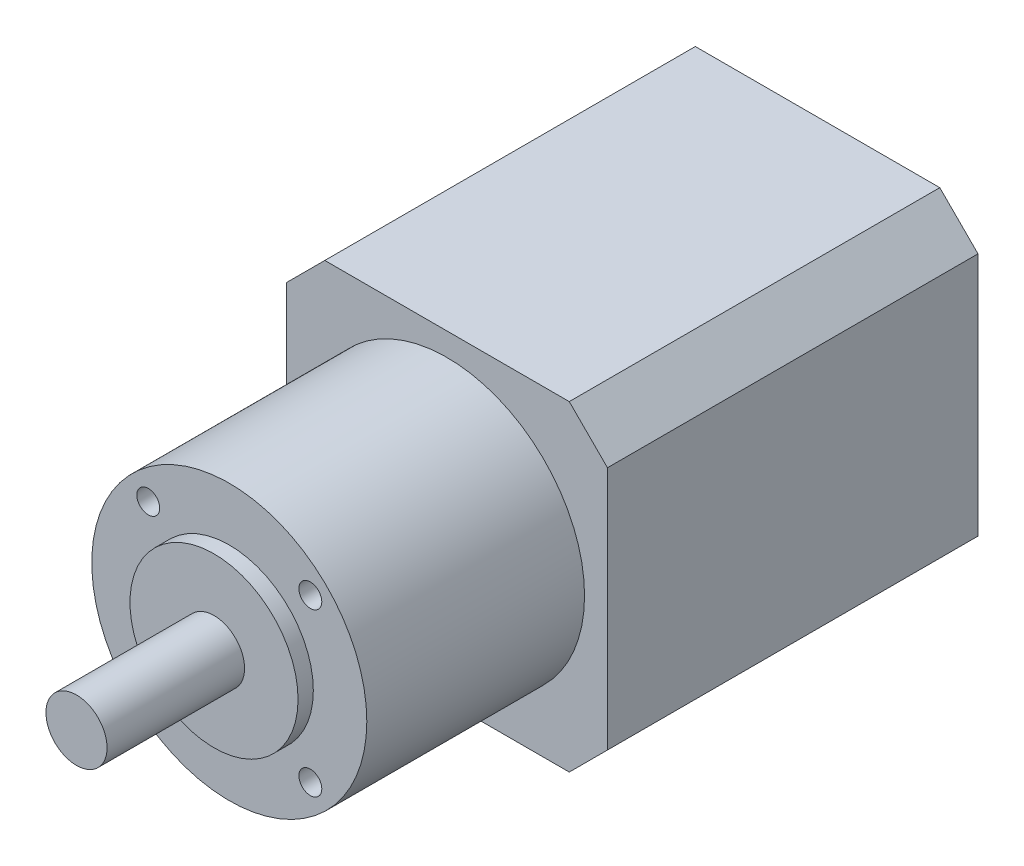
ISO-10303-21;
HEADER;
FILE_DESCRIPTION(('STEP AP214'),'2;1');
FILE_NAME('part.step','',(''),(''),'','','');
FILE_SCHEMA(('AUTOMOTIVE_DESIGN { 1 0 10303 214 1 1 1 1 }'));
ENDSEC;
DATA;
#1=APPLICATION_CONTEXT('core data for automotive mechanical design processes');
#2=APPLICATION_PROTOCOL_DEFINITION('international standard','automotive_design',2000,#1);
#3=PRODUCT_CONTEXT('',#1,'mechanical');
#4=PRODUCT('Part','Part','',(#3));
#5=PRODUCT_RELATED_PRODUCT_CATEGORY('part','',(#4));
#6=PRODUCT_DEFINITION_FORMATION('','',#4);
#7=PRODUCT_DEFINITION_CONTEXT('part definition',#1,'design');
#8=PRODUCT_DEFINITION('design','',#6,#7);
#9=PRODUCT_DEFINITION_SHAPE('','',#8);
#10=(LENGTH_UNIT() NAMED_UNIT(*) SI_UNIT(.MILLI.,.METRE.));
#11=(NAMED_UNIT(*) PLANE_ANGLE_UNIT() SI_UNIT($,.RADIAN.));
#12=(NAMED_UNIT(*) SI_UNIT($,.STERADIAN.) SOLID_ANGLE_UNIT());
#13=UNCERTAINTY_MEASURE_WITH_UNIT(LENGTH_MEASURE(1.E-05),#10,'distance_accuracy_value','');
#14=(GEOMETRIC_REPRESENTATION_CONTEXT(3) GLOBAL_UNCERTAINTY_ASSIGNED_CONTEXT((#13)) GLOBAL_UNIT_ASSIGNED_CONTEXT((#10,
#11,#12)) REPRESENTATION_CONTEXT('',''));
#15=CARTESIAN_POINT('',(0.,0.,0.));
#16=DIRECTION('',(0.,0.,1.));
#17=DIRECTION('',(1.,0.,0.));
#18=AXIS2_PLACEMENT_3D('',#15,#16,#17);
#19=CARTESIAN_POINT('',(21.,21.,48.5));
#20=DIRECTION('',(-1.,0.,0.));
#21=DIRECTION('',(0.,-1.,0.));
#22=AXIS2_PLACEMENT_3D('',#19,#20,#21);
#23=PLANE('',#22);
#24=DIRECTION('',(0.,1.,0.));
#25=VECTOR('',#24,1.);
#26=CARTESIAN_POINT('',(21.,21.,48.5));
#27=LINE('',#26,#25);
#28=CARTESIAN_POINT('',(21.,-16.,48.5));
#29=VERTEX_POINT('',#28);
#30=CARTESIAN_POINT('',(21.,16.,48.5));
#31=VERTEX_POINT('',#30);
#32=EDGE_CURVE('E122',#29,#31,#27,.T.);
#33=ORIENTED_EDGE('',*,*,#32,.F.);
#34=DIRECTION('',(0.,0.,-1.));
#35=VECTOR('',#34,1.);
#36=CARTESIAN_POINT('',(21.,-16.,48.5));
#37=LINE('',#36,#35);
#38=CARTESIAN_POINT('',(21.,-16.,0.));
#39=VERTEX_POINT('',#38);
#40=EDGE_CURVE('E107',#29,#39,#37,.T.);
#41=ORIENTED_EDGE('',*,*,#40,.T.);
#42=DIRECTION('',(0.,1.,0.));
#43=VECTOR('',#42,1.);
#44=CARTESIAN_POINT('',(21.,21.,0.));
#45=LINE('',#44,#43);
#46=CARTESIAN_POINT('',(21.,16.,0.));
#47=VERTEX_POINT('',#46);
#48=EDGE_CURVE('E119',#39,#47,#45,.T.);
#49=ORIENTED_EDGE('',*,*,#48,.T.);
#50=DIRECTION('',(0.,0.,1.));
#51=VECTOR('',#50,1.);
#52=CARTESIAN_POINT('',(21.,16.,48.5));
#53=LINE('',#52,#51);
#54=EDGE_CURVE('E124',#47,#31,#53,.T.);
#55=ORIENTED_EDGE('',*,*,#54,.T.);
#56=EDGE_LOOP('',(#33,#41,#49,#55));
#57=FACE_BOUND('',#56,.T.);
#58=ADVANCED_FACE('F37',(#57),#23,.F.);
#59=CARTESIAN_POINT('',(-21.,21.,48.5));
#60=DIRECTION('',(0.,-1.,0.));
#61=DIRECTION('',(0.,0.,-1.));
#62=AXIS2_PLACEMENT_3D('',#59,#60,#61);
#63=PLANE('',#62);
#64=DIRECTION('',(-1.,0.,0.));
#65=VECTOR('',#64,1.);
#66=CARTESIAN_POINT('',(-21.,21.,48.5));
#67=LINE('',#66,#65);
#68=CARTESIAN_POINT('',(16.,21.,48.5));
#69=VERTEX_POINT('',#68);
#70=CARTESIAN_POINT('',(-16.,21.,48.5));
#71=VERTEX_POINT('',#70);
#72=EDGE_CURVE('E169',#69,#71,#67,.T.);
#73=ORIENTED_EDGE('',*,*,#72,.F.);
#74=DIRECTION('',(0.,0.,-1.));
#75=VECTOR('',#74,1.);
#76=CARTESIAN_POINT('',(16.,21.,48.5));
#77=LINE('',#76,#75);
#78=CARTESIAN_POINT('',(16.,21.,0.));
#79=VERTEX_POINT('',#78);
#80=EDGE_CURVE('E162',#69,#79,#77,.T.);
#81=ORIENTED_EDGE('',*,*,#80,.T.);
#82=DIRECTION('',(-1.,0.,0.));
#83=VECTOR('',#82,1.);
#84=CARTESIAN_POINT('',(-21.,21.,0.));
#85=LINE('',#84,#83);
#86=CARTESIAN_POINT('',(-16.,21.,0.));
#87=VERTEX_POINT('',#86);
#88=EDGE_CURVE('E128',#79,#87,#85,.T.);
#89=ORIENTED_EDGE('',*,*,#88,.T.);
#90=DIRECTION('',(0.,0.,1.));
#91=VECTOR('',#90,1.);
#92=CARTESIAN_POINT('',(-16.,21.,48.5));
#93=LINE('',#92,#91);
#94=EDGE_CURVE('E160',#87,#71,#93,.T.);
#95=ORIENTED_EDGE('',*,*,#94,.T.);
#96=EDGE_LOOP('',(#73,#81,#89,#95));
#97=FACE_BOUND('',#96,.T.);
#98=ADVANCED_FACE('F167',(#97),#63,.F.);
#99=CARTESIAN_POINT('',(-21.,21.,48.5));
#100=DIRECTION('',(1.,0.,0.));
#101=DIRECTION('',(0.,1.,0.));
#102=AXIS2_PLACEMENT_3D('',#99,#100,#101);
#103=PLANE('',#102);
#104=DIRECTION('',(0.,-1.,0.));
#105=VECTOR('',#104,1.);
#106=CARTESIAN_POINT('',(-21.,21.,48.5));
#107=LINE('',#106,#105);
#108=CARTESIAN_POINT('',(-21.,16.,48.5));
#109=VERTEX_POINT('',#108);
#110=CARTESIAN_POINT('',(-21.,-16.,48.5));
#111=VERTEX_POINT('',#110);
#112=EDGE_CURVE('E177',#109,#111,#107,.T.);
#113=ORIENTED_EDGE('',*,*,#112,.F.);
#114=DIRECTION('',(0.,0.,-1.));
#115=VECTOR('',#114,1.);
#116=CARTESIAN_POINT('',(-21.,16.,48.5));
#117=LINE('',#116,#115);
#118=CARTESIAN_POINT('',(-21.,16.,0.));
#119=VERTEX_POINT('',#118);
#120=EDGE_CURVE('E11',#109,#119,#117,.T.);
#121=ORIENTED_EDGE('',*,*,#120,.T.);
#122=DIRECTION('',(0.,-1.,0.));
#123=VECTOR('',#122,1.);
#124=CARTESIAN_POINT('',(-21.,21.,0.));
#125=LINE('',#124,#123);
#126=CARTESIAN_POINT('',(-21.,-16.,0.));
#127=VERTEX_POINT('',#126);
#128=EDGE_CURVE('E132',#119,#127,#125,.T.);
#129=ORIENTED_EDGE('',*,*,#128,.T.);
#130=DIRECTION('',(0.,0.,1.));
#131=VECTOR('',#130,1.);
#132=CARTESIAN_POINT('',(-21.,-16.,48.5));
#133=LINE('',#132,#131);
#134=EDGE_CURVE('E45',#127,#111,#133,.T.);
#135=ORIENTED_EDGE('',*,*,#134,.T.);
#136=EDGE_LOOP('',(#113,#121,#129,#135));
#137=FACE_BOUND('',#136,.T.);
#138=ADVANCED_FACE('F176',(#137),#103,.F.);
#139=CARTESIAN_POINT('',(-21.,-21.,48.5));
#140=DIRECTION('',(0.,1.,0.));
#141=DIRECTION('',(0.,0.,1.));
#142=AXIS2_PLACEMENT_3D('',#139,#140,#141);
#143=PLANE('',#142);
#144=DIRECTION('',(1.,0.,0.));
#145=VECTOR('',#144,1.);
#146=CARTESIAN_POINT('',(-21.,-21.,0.));
#147=LINE('',#146,#145);
#148=CARTESIAN_POINT('',(-16.,-21.,0.));
#149=VERTEX_POINT('',#148);
#150=CARTESIAN_POINT('',(16.,-21.,0.));
#151=VERTEX_POINT('',#150);
#152=EDGE_CURVE('E142',#149,#151,#147,.T.);
#153=ORIENTED_EDGE('',*,*,#152,.T.);
#154=DIRECTION('',(0.,0.,1.));
#155=VECTOR('',#154,1.);
#156=CARTESIAN_POINT('',(16.,-21.,48.5));
#157=LINE('',#156,#155);
#158=CARTESIAN_POINT('',(16.,-21.,48.5));
#159=VERTEX_POINT('',#158);
#160=EDGE_CURVE('E108',#151,#159,#157,.T.);
#161=ORIENTED_EDGE('',*,*,#160,.T.);
#162=DIRECTION('',(1.,0.,0.));
#163=VECTOR('',#162,1.);
#164=CARTESIAN_POINT('',(-21.,-21.,48.5));
#165=LINE('',#164,#163);
#166=CARTESIAN_POINT('',(-16.,-21.,48.5));
#167=VERTEX_POINT('',#166);
#168=EDGE_CURVE('E138',#167,#159,#165,.T.);
#169=ORIENTED_EDGE('',*,*,#168,.F.);
#170=DIRECTION('',(0.,0.,-1.));
#171=VECTOR('',#170,1.);
#172=CARTESIAN_POINT('',(-16.,-21.,48.5));
#173=LINE('',#172,#171);
#174=EDGE_CURVE('E113',#167,#149,#173,.T.);
#175=ORIENTED_EDGE('',*,*,#174,.T.);
#176=EDGE_LOOP('',(#153,#161,#169,#175));
#177=FACE_BOUND('',#176,.T.);
#178=ADVANCED_FACE('F243',(#177),#143,.F.);
#179=CARTESIAN_POINT('',(0.,0.,48.5));
#180=DIRECTION('',(0.,0.,1.));
#181=DIRECTION('',(1.,0.,0.));
#182=AXIS2_PLACEMENT_3D('',#179,#180,#181);
#183=PLANE('',#182);
#184=CARTESIAN_POINT('',(0.,0.,48.5));
#185=DIRECTION('',(0.,0.,1.));
#186=DIRECTION('',(1.,0.,0.));
#187=AXIS2_PLACEMENT_3D('',#184,#185,#186);
#188=CIRCLE('',#187,18.);
#189=CARTESIAN_POINT('',(18.,0.,48.5));
#190=VERTEX_POINT('',#189);
#191=EDGE_CURVE('E144',#190,#190,#188,.T.);
#192=ORIENTED_EDGE('',*,*,#191,.F.);
#193=EDGE_LOOP('',(#192));
#194=FACE_BOUND('',#193,.T.);
#195=ORIENTED_EDGE('',*,*,#168,.T.);
#196=DIRECTION('',(-0.70710678118655,-0.707106781186546,0.));
#197=VECTOR('',#196,1.);
#198=CARTESIAN_POINT('',(18.4999999999999,-18.5,48.5));
#199=LINE('',#198,#197);
#200=EDGE_CURVE('E158',#159,#29,#199,.F.);
#201=ORIENTED_EDGE('',*,*,#200,.T.);
#202=ORIENTED_EDGE('',*,*,#32,.T.);
#203=DIRECTION('',(0.707106781186546,-0.707106781186549,0.));
#204=VECTOR('',#203,1.);
#205=CARTESIAN_POINT('',(18.5,18.5,48.5));
#206=LINE('',#205,#204);
#207=EDGE_CURVE('E156',#31,#69,#206,.F.);
#208=ORIENTED_EDGE('',*,*,#207,.T.);
#209=ORIENTED_EDGE('',*,*,#72,.T.);
#210=DIRECTION('',(0.707106781186548,0.707106781186547,0.));
#211=VECTOR('',#210,1.);
#212=CARTESIAN_POINT('',(-18.5,18.5,48.5));
#213=LINE('',#212,#211);
#214=EDGE_CURVE('E58',#71,#109,#213,.F.);
#215=ORIENTED_EDGE('',*,*,#214,.T.);
#216=ORIENTED_EDGE('',*,*,#112,.T.);
#217=DIRECTION('',(-0.707106781186546,0.707106781186549,0.));
#218=VECTOR('',#217,1.);
#219=CARTESIAN_POINT('',(-18.5,-18.5,48.5));
#220=LINE('',#219,#218);
#221=EDGE_CURVE('E153',#111,#167,#220,.F.);
#222=ORIENTED_EDGE('',*,*,#221,.T.);
#223=EDGE_LOOP('',(#195,#201,#202,#208,#209,#215,#216,#222));
#224=FACE_BOUND('',#223,.T.);
#225=ADVANCED_FACE('F241',(#194,#224),#183,.T.);
#226=CARTESIAN_POINT('',(0.,0.,0.));
#227=DIRECTION('',(0.,0.,1.));
#228=DIRECTION('',(1.,0.,0.));
#229=AXIS2_PLACEMENT_3D('',#226,#227,#228);
#230=PLANE('',#229);
#231=ORIENTED_EDGE('',*,*,#48,.F.);
#232=DIRECTION('',(0.70710678118655,0.707106781186546,0.));
#233=VECTOR('',#232,1.);
#234=CARTESIAN_POINT('',(21.,-16.,0.));
#235=LINE('',#234,#233);
#236=EDGE_CURVE('E103',#39,#151,#235,.F.);
#237=ORIENTED_EDGE('',*,*,#236,.T.);
#238=ORIENTED_EDGE('',*,*,#152,.F.);
#239=DIRECTION('',(0.707106781186546,-0.707106781186549,0.));
#240=VECTOR('',#239,1.);
#241=CARTESIAN_POINT('',(-16.,-21.,0.));
#242=LINE('',#241,#240);
#243=EDGE_CURVE('E123',#149,#127,#242,.F.);
#244=ORIENTED_EDGE('',*,*,#243,.T.);
#245=ORIENTED_EDGE('',*,*,#128,.F.);
#246=DIRECTION('',(-0.707106781186548,-0.707106781186547,0.));
#247=VECTOR('',#246,1.);
#248=CARTESIAN_POINT('',(-21.,16.,0.));
#249=LINE('',#248,#247);
#250=EDGE_CURVE('E147',#119,#87,#249,.F.);
#251=ORIENTED_EDGE('',*,*,#250,.T.);
#252=ORIENTED_EDGE('',*,*,#88,.F.);
#253=DIRECTION('',(-0.707106781186546,0.707106781186549,0.));
#254=VECTOR('',#253,1.);
#255=CARTESIAN_POINT('',(16.,21.,0.));
#256=LINE('',#255,#254);
#257=EDGE_CURVE('E114',#79,#47,#256,.F.);
#258=ORIENTED_EDGE('',*,*,#257,.T.);
#259=EDGE_LOOP('',(#231,#237,#238,#244,#245,#251,#252,#258));
#260=FACE_BOUND('',#259,.T.);
#261=ADVANCED_FACE('F126',(#260),#230,.F.);
#262=CARTESIAN_POINT('',(0.,0.,77.));
#263=DIRECTION('',(0.,0.,-1.));
#264=DIRECTION('',(-1.,0.,0.));
#265=AXIS2_PLACEMENT_3D('',#262,#263,#264);
#266=CYLINDRICAL_SURFACE('',#265,18.);
#267=CARTESIAN_POINT('',(0.,0.,77.));
#268=DIRECTION('',(0.,0.,1.));
#269=DIRECTION('',(1.,0.,0.));
#270=AXIS2_PLACEMENT_3D('',#267,#268,#269);
#271=CIRCLE('',#270,18.);
#272=CARTESIAN_POINT('',(18.,0.,77.));
#273=VERTEX_POINT('',#272);
#274=EDGE_CURVE('E129',#273,#273,#271,.T.);
#275=ORIENTED_EDGE('',*,*,#274,.F.);
#276=EDGE_LOOP('',(#275));
#277=FACE_BOUND('',#276,.T.);
#278=ORIENTED_EDGE('',*,*,#191,.T.);
#279=EDGE_LOOP('',(#278));
#280=FACE_BOUND('',#279,.T.);
#281=ADVANCED_FACE('F227',(#277,#280),#266,.T.);
#282=CARTESIAN_POINT('',(0.,0.,77.));
#283=DIRECTION('',(0.,0.,1.));
#284=DIRECTION('',(1.,0.,0.));
#285=AXIS2_PLACEMENT_3D('',#282,#283,#284);
#286=PLANE('',#285);
#287=CARTESIAN_POINT('',(10.6066017177982,-10.6066017177982,77.));
#288=DIRECTION('',(0.,0.,1.));
#289=DIRECTION('',(1.,0.,0.));
#290=AXIS2_PLACEMENT_3D('',#287,#288,#289);
#291=CIRCLE('',#290,1.5);
#292=CARTESIAN_POINT('',(12.1066017177982,-10.6066017177982,77.));
#293=VERTEX_POINT('',#292);
#294=EDGE_CURVE('E206',#293,#293,#291,.T.);
#295=ORIENTED_EDGE('',*,*,#294,.F.);
#296=EDGE_LOOP('',(#295));
#297=FACE_BOUND('',#296,.T.);
#298=CARTESIAN_POINT('',(10.6066017177983,10.6066017177981,77.));
#299=DIRECTION('',(0.,0.,1.));
#300=DIRECTION('',(1.,0.,0.));
#301=AXIS2_PLACEMENT_3D('',#298,#299,#300);
#302=CIRCLE('',#301,1.5);
#303=CARTESIAN_POINT('',(12.1066017177983,10.6066017177981,77.));
#304=VERTEX_POINT('',#303);
#305=EDGE_CURVE('E212',#304,#304,#302,.T.);
#306=ORIENTED_EDGE('',*,*,#305,.F.);
#307=EDGE_LOOP('',(#306));
#308=FACE_BOUND('',#307,.T.);
#309=CARTESIAN_POINT('',(-10.6066017177981,10.6066017177983,77.));
#310=DIRECTION('',(0.,0.,1.));
#311=DIRECTION('',(1.,0.,0.));
#312=AXIS2_PLACEMENT_3D('',#309,#310,#311);
#313=CIRCLE('',#312,1.5);
#314=CARTESIAN_POINT('',(-9.10660171779814,10.6066017177983,77.));
#315=VERTEX_POINT('',#314);
#316=EDGE_CURVE('E200',#315,#315,#313,.T.);
#317=ORIENTED_EDGE('',*,*,#316,.F.);
#318=EDGE_LOOP('',(#317));
#319=FACE_BOUND('',#318,.T.);
#320=CARTESIAN_POINT('',(-10.6066017177982,-10.6066017177982,77.));
#321=DIRECTION('',(0.,0.,1.));
#322=DIRECTION('',(1.,0.,0.));
#323=AXIS2_PLACEMENT_3D('',#320,#321,#322);
#324=CIRCLE('',#323,1.5);
#325=CARTESIAN_POINT('',(-9.10660171779825,-10.6066017177982,77.));
#326=VERTEX_POINT('',#325);
#327=EDGE_CURVE('E197',#326,#326,#324,.T.);
#328=ORIENTED_EDGE('',*,*,#327,.F.);
#329=EDGE_LOOP('',(#328));
#330=FACE_BOUND('',#329,.T.);
#331=CARTESIAN_POINT('',(0.,0.,77.));
#332=DIRECTION('',(0.,0.,1.));
#333=DIRECTION('',(1.,0.,0.));
#334=AXIS2_PLACEMENT_3D('',#331,#332,#333);
#335=CIRCLE('',#334,11.);
#336=CARTESIAN_POINT('',(11.,0.,77.));
#337=VERTEX_POINT('',#336);
#338=EDGE_CURVE('E185',#337,#337,#335,.T.);
#339=ORIENTED_EDGE('',*,*,#338,.F.);
#340=EDGE_LOOP('',(#339));
#341=FACE_BOUND('',#340,.T.);
#342=ORIENTED_EDGE('',*,*,#274,.T.);
#343=EDGE_LOOP('',(#342));
#344=FACE_BOUND('',#343,.T.);
#345=ADVANCED_FACE('F223',(#297,#308,#319,#330,#341,#344),#286,.T.);
#346=CARTESIAN_POINT('',(0.,0.,79.));
#347=DIRECTION('',(0.,0.,1.));
#348=DIRECTION('',(1.,0.,0.));
#349=AXIS2_PLACEMENT_3D('',#346,#347,#348);
#350=PLANE('',#349);
#351=CARTESIAN_POINT('',(0.,0.,79.));
#352=DIRECTION('',(0.,0.,1.));
#353=DIRECTION('',(1.,0.,0.));
#354=AXIS2_PLACEMENT_3D('',#351,#352,#353);
#355=CIRCLE('',#354,11.);
#356=CARTESIAN_POINT('',(11.,0.,79.));
#357=VERTEX_POINT('',#356);
#358=EDGE_CURVE('E135',#357,#357,#355,.T.);
#359=ORIENTED_EDGE('',*,*,#358,.T.);
#360=EDGE_LOOP('',(#359));
#361=FACE_BOUND('',#360,.T.);
#362=CARTESIAN_POINT('',(0.,0.,79.));
#363=DIRECTION('',(0.,0.,1.));
#364=DIRECTION('',(1.,0.,0.));
#365=AXIS2_PLACEMENT_3D('',#362,#363,#364);
#366=CIRCLE('',#365,4.);
#367=CARTESIAN_POINT('',(4.,0.,79.));
#368=VERTEX_POINT('',#367);
#369=EDGE_CURVE('E188',#368,#368,#366,.T.);
#370=ORIENTED_EDGE('',*,*,#369,.F.);
#371=EDGE_LOOP('',(#370));
#372=FACE_BOUND('',#371,.T.);
#373=ADVANCED_FACE('F226',(#361,#372),#350,.T.);
#374=CARTESIAN_POINT('',(0.,0.,79.));
#375=DIRECTION('',(0.,0.,-1.));
#376=DIRECTION('',(-1.,0.,0.));
#377=AXIS2_PLACEMENT_3D('',#374,#375,#376);
#378=CYLINDRICAL_SURFACE('',#377,11.);
#379=ORIENTED_EDGE('',*,*,#358,.F.);
#380=EDGE_LOOP('',(#379));
#381=FACE_BOUND('',#380,.T.);
#382=ORIENTED_EDGE('',*,*,#338,.T.);
#383=EDGE_LOOP('',(#382));
#384=FACE_BOUND('',#383,.T.);
#385=ADVANCED_FACE('F376',(#381,#384),#378,.T.);
#386=CARTESIAN_POINT('',(0.,0.,97.));
#387=DIRECTION('',(0.,0.,-1.));
#388=DIRECTION('',(-1.,0.,0.));
#389=AXIS2_PLACEMENT_3D('',#386,#387,#388);
#390=CYLINDRICAL_SURFACE('',#389,4.);
#391=ORIENTED_EDGE('',*,*,#369,.T.);
#392=EDGE_LOOP('',(#391));
#393=FACE_BOUND('',#392,.T.);
#394=CARTESIAN_POINT('',(0.,0.,97.));
#395=DIRECTION('',(0.,0.,1.));
#396=DIRECTION('',(1.,0.,0.));
#397=AXIS2_PLACEMENT_3D('',#394,#395,#396);
#398=CIRCLE('',#397,4.);
#399=CARTESIAN_POINT('',(4.,0.,97.));
#400=VERTEX_POINT('',#399);
#401=EDGE_CURVE('E193',#400,#400,#398,.T.);
#402=ORIENTED_EDGE('',*,*,#401,.F.);
#403=EDGE_LOOP('',(#402));
#404=FACE_BOUND('',#403,.T.);
#405=ADVANCED_FACE('F367',(#393,#404),#390,.T.);
#406=CARTESIAN_POINT('',(0.,0.,97.));
#407=DIRECTION('',(0.,0.,1.));
#408=DIRECTION('',(1.,0.,0.));
#409=AXIS2_PLACEMENT_3D('',#406,#407,#408);
#410=PLANE('',#409);
#411=ORIENTED_EDGE('',*,*,#401,.T.);
#412=EDGE_LOOP('',(#411));
#413=FACE_BOUND('',#412,.T.);
#414=ADVANCED_FACE('F357',(#413),#410,.T.);
#415=CARTESIAN_POINT('',(-10.6066017177982,-10.6066017177982,67.));
#416=DIRECTION('',(0.,0.,1.));
#417=DIRECTION('',(1.,0.,0.));
#418=AXIS2_PLACEMENT_3D('',#415,#416,#417);
#419=CYLINDRICAL_SURFACE('',#418,1.5);
#420=CARTESIAN_POINT('',(-10.6066017177982,-10.6066017177982,67.));
#421=DIRECTION('',(0.,0.,1.));
#422=DIRECTION('',(1.,0.,0.));
#423=AXIS2_PLACEMENT_3D('',#420,#421,#422);
#424=CIRCLE('',#423,1.5);
#425=CARTESIAN_POINT('',(-9.10660171779825,-10.6066017177982,67.));
#426=VERTEX_POINT('',#425);
#427=EDGE_CURVE('E196',#426,#426,#424,.T.);
#428=ORIENTED_EDGE('',*,*,#427,.F.);
#429=EDGE_LOOP('',(#428));
#430=FACE_BOUND('',#429,.T.);
#431=ORIENTED_EDGE('',*,*,#327,.T.);
#432=EDGE_LOOP('',(#431));
#433=FACE_BOUND('',#432,.T.);
#434=ADVANCED_FACE('F348',(#430,#433),#419,.F.);
#435=CARTESIAN_POINT('',(-10.6066017177982,-10.6066017177982,67.));
#436=DIRECTION('',(0.,0.,1.));
#437=DIRECTION('',(1.,0.,0.));
#438=AXIS2_PLACEMENT_3D('',#435,#436,#437);
#439=PLANE('',#438);
#440=ORIENTED_EDGE('',*,*,#427,.T.);
#441=EDGE_LOOP('',(#440));
#442=FACE_BOUND('',#441,.T.);
#443=ADVANCED_FACE('F339',(#442),#439,.T.);
#444=CARTESIAN_POINT('',(-10.6066017177981,10.6066017177983,67.));
#445=DIRECTION('',(0.,0.,1.));
#446=DIRECTION('',(1.,0.,0.));
#447=AXIS2_PLACEMENT_3D('',#444,#445,#446);
#448=CYLINDRICAL_SURFACE('',#447,1.5);
#449=CARTESIAN_POINT('',(-10.6066017177981,10.6066017177983,67.));
#450=DIRECTION('',(0.,0.,1.));
#451=DIRECTION('',(1.,0.,0.));
#452=AXIS2_PLACEMENT_3D('',#449,#450,#451);
#453=CIRCLE('',#452,1.5);
#454=CARTESIAN_POINT('',(-9.10660171779814,10.6066017177983,67.));
#455=VERTEX_POINT('',#454);
#456=EDGE_CURVE('E215',#455,#455,#453,.T.);
#457=ORIENTED_EDGE('',*,*,#456,.F.);
#458=EDGE_LOOP('',(#457));
#459=FACE_BOUND('',#458,.T.);
#460=ORIENTED_EDGE('',*,*,#316,.T.);
#461=EDGE_LOOP('',(#460));
#462=FACE_BOUND('',#461,.T.);
#463=ADVANCED_FACE('F221',(#459,#462),#448,.F.);
#464=CARTESIAN_POINT('',(-10.6066017177981,10.6066017177983,67.));
#465=DIRECTION('',(0.,0.,1.));
#466=DIRECTION('',(1.,0.,0.));
#467=AXIS2_PLACEMENT_3D('',#464,#465,#466);
#468=PLANE('',#467);
#469=ORIENTED_EDGE('',*,*,#456,.T.);
#470=EDGE_LOOP('',(#469));
#471=FACE_BOUND('',#470,.T.);
#472=ADVANCED_FACE('F322',(#471),#468,.T.);
#473=CARTESIAN_POINT('',(10.6066017177983,10.6066017177981,67.));
#474=DIRECTION('',(0.,0.,1.));
#475=DIRECTION('',(1.,0.,0.));
#476=AXIS2_PLACEMENT_3D('',#473,#474,#475);
#477=CYLINDRICAL_SURFACE('',#476,1.5);
#478=CARTESIAN_POINT('',(10.6066017177983,10.6066017177981,67.));
#479=DIRECTION('',(0.,0.,1.));
#480=DIRECTION('',(1.,0.,0.));
#481=AXIS2_PLACEMENT_3D('',#478,#479,#480);
#482=CIRCLE('',#481,1.5);
#483=CARTESIAN_POINT('',(12.1066017177983,10.6066017177981,67.));
#484=VERTEX_POINT('',#483);
#485=EDGE_CURVE('E209',#484,#484,#482,.T.);
#486=ORIENTED_EDGE('',*,*,#485,.F.);
#487=EDGE_LOOP('',(#486));
#488=FACE_BOUND('',#487,.T.);
#489=ORIENTED_EDGE('',*,*,#305,.T.);
#490=EDGE_LOOP('',(#489));
#491=FACE_BOUND('',#490,.T.);
#492=ADVANCED_FACE('F313',(#488,#491),#477,.F.);
#493=CARTESIAN_POINT('',(10.6066017177983,10.6066017177981,67.));
#494=DIRECTION('',(0.,0.,1.));
#495=DIRECTION('',(1.,0.,0.));
#496=AXIS2_PLACEMENT_3D('',#493,#494,#495);
#497=PLANE('',#496);
#498=ORIENTED_EDGE('',*,*,#485,.T.);
#499=EDGE_LOOP('',(#498));
#500=FACE_BOUND('',#499,.T.);
#501=ADVANCED_FACE('F304',(#500),#497,.T.);
#502=CARTESIAN_POINT('',(10.6066017177982,-10.6066017177982,67.));
#503=DIRECTION('',(0.,0.,1.));
#504=DIRECTION('',(1.,0.,0.));
#505=AXIS2_PLACEMENT_3D('',#502,#503,#504);
#506=CYLINDRICAL_SURFACE('',#505,1.5);
#507=CARTESIAN_POINT('',(10.6066017177982,-10.6066017177982,67.));
#508=DIRECTION('',(0.,0.,1.));
#509=DIRECTION('',(1.,0.,0.));
#510=AXIS2_PLACEMENT_3D('',#507,#508,#509);
#511=CIRCLE('',#510,1.5);
#512=CARTESIAN_POINT('',(12.1066017177982,-10.6066017177982,67.));
#513=VERTEX_POINT('',#512);
#514=EDGE_CURVE('E203',#513,#513,#511,.T.);
#515=ORIENTED_EDGE('',*,*,#514,.F.);
#516=EDGE_LOOP('',(#515));
#517=FACE_BOUND('',#516,.T.);
#518=ORIENTED_EDGE('',*,*,#294,.T.);
#519=EDGE_LOOP('',(#518));
#520=FACE_BOUND('',#519,.T.);
#521=ADVANCED_FACE('F295',(#517,#520),#506,.F.);
#522=CARTESIAN_POINT('',(10.6066017177982,-10.6066017177982,67.));
#523=DIRECTION('',(0.,0.,1.));
#524=DIRECTION('',(1.,0.,0.));
#525=AXIS2_PLACEMENT_3D('',#522,#523,#524);
#526=PLANE('',#525);
#527=ORIENTED_EDGE('',*,*,#514,.T.);
#528=EDGE_LOOP('',(#527));
#529=FACE_BOUND('',#528,.T.);
#530=ADVANCED_FACE('F264',(#529),#526,.T.);
#531=CARTESIAN_POINT('',(21.,-16.,48.5));
#532=DIRECTION('',(-0.707106781186545,0.707106781186549,0.));
#533=DIRECTION('',(0.,0.,-1.));
#534=AXIS2_PLACEMENT_3D('',#531,#532,#533);
#535=PLANE('',#534);
#536=ORIENTED_EDGE('',*,*,#200,.F.);
#537=ORIENTED_EDGE('',*,*,#160,.F.);
#538=ORIENTED_EDGE('',*,*,#236,.F.);
#539=ORIENTED_EDGE('',*,*,#40,.F.);
#540=EDGE_LOOP('',(#536,#537,#538,#539));
#541=FACE_BOUND('',#540,.T.);
#542=ADVANCED_FACE('F106',(#541),#535,.F.);
#543=CARTESIAN_POINT('',(16.,21.,48.5));
#544=DIRECTION('',(-0.707106781186549,-0.707106781186546,0.));
#545=DIRECTION('',(0.,0.,-1.));
#546=AXIS2_PLACEMENT_3D('',#543,#544,#545);
#547=PLANE('',#546);
#548=ORIENTED_EDGE('',*,*,#207,.F.);
#549=ORIENTED_EDGE('',*,*,#54,.F.);
#550=ORIENTED_EDGE('',*,*,#257,.F.);
#551=ORIENTED_EDGE('',*,*,#80,.F.);
#552=EDGE_LOOP('',(#548,#549,#550,#551));
#553=FACE_BOUND('',#552,.T.);
#554=ADVANCED_FACE('F253',(#553),#547,.F.);
#555=CARTESIAN_POINT('',(-21.,16.,48.5));
#556=DIRECTION('',(0.707106781186547,-0.707106781186548,0.));
#557=DIRECTION('',(0.,0.,-1.));
#558=AXIS2_PLACEMENT_3D('',#555,#556,#557);
#559=PLANE('',#558);
#560=ORIENTED_EDGE('',*,*,#214,.F.);
#561=ORIENTED_EDGE('',*,*,#94,.F.);
#562=ORIENTED_EDGE('',*,*,#250,.F.);
#563=ORIENTED_EDGE('',*,*,#120,.F.);
#564=EDGE_LOOP('',(#560,#561,#562,#563));
#565=FACE_BOUND('',#564,.T.);
#566=ADVANCED_FACE('F175',(#565),#559,.F.);
#567=CARTESIAN_POINT('',(-16.,-21.,48.5));
#568=DIRECTION('',(0.707106781186549,0.707106781186546,0.));
#569=DIRECTION('',(0.,0.,-1.));
#570=AXIS2_PLACEMENT_3D('',#567,#568,#569);
#571=PLANE('',#570);
#572=ORIENTED_EDGE('',*,*,#221,.F.);
#573=ORIENTED_EDGE('',*,*,#134,.F.);
#574=ORIENTED_EDGE('',*,*,#243,.F.);
#575=ORIENTED_EDGE('',*,*,#174,.F.);
#576=EDGE_LOOP('',(#572,#573,#574,#575));
#577=FACE_BOUND('',#576,.T.);
#578=ADVANCED_FACE('F39',(#577),#571,.F.);
#579=CLOSED_SHELL('',(#58,#98,#138,#178,#225,#261,#281,#345,#373,#385,#405,#414,#434,#443,#463,
#472,#492,#501,#521,#530,#542,#554,#566,#578));
#580=MANIFOLD_SOLID_BREP('B2',#579);
#581=ADVANCED_BREP_SHAPE_REPRESENTATION('',(#18,#580),#14);
#582=SHAPE_DEFINITION_REPRESENTATION(#9,#581);
ENDSEC;
END-ISO-10303-21;
